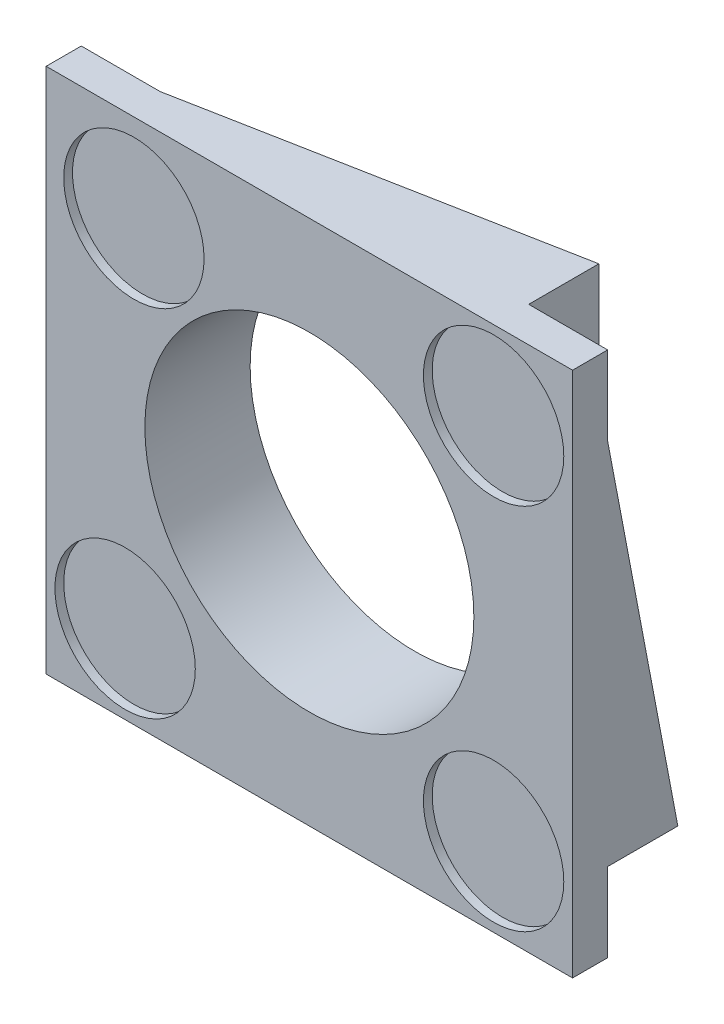
ISO-10303-21;
HEADER;
FILE_DESCRIPTION(('STEP AP214'),'2;1');
FILE_NAME('part.step','',(''),(''),'','','');
FILE_SCHEMA(('AUTOMOTIVE_DESIGN { 1 0 10303 214 1 1 1 1 }'));
ENDSEC;
DATA;
#1=APPLICATION_CONTEXT('core data for automotive mechanical design processes');
#2=APPLICATION_PROTOCOL_DEFINITION('international standard','automotive_design',2000,#1);
#3=PRODUCT_CONTEXT('',#1,'mechanical');
#4=PRODUCT('Part','Part','',(#3));
#5=PRODUCT_RELATED_PRODUCT_CATEGORY('part','',(#4));
#6=PRODUCT_DEFINITION_FORMATION('','',#4);
#7=PRODUCT_DEFINITION_CONTEXT('part definition',#1,'design');
#8=PRODUCT_DEFINITION('design','',#6,#7);
#9=PRODUCT_DEFINITION_SHAPE('','',#8);
#10=(LENGTH_UNIT() NAMED_UNIT(*) SI_UNIT(.MILLI.,.METRE.));
#11=(NAMED_UNIT(*) PLANE_ANGLE_UNIT() SI_UNIT($,.RADIAN.));
#12=(NAMED_UNIT(*) SI_UNIT($,.STERADIAN.) SOLID_ANGLE_UNIT());
#13=UNCERTAINTY_MEASURE_WITH_UNIT(LENGTH_MEASURE(1.E-05),#10,'distance_accuracy_value','');
#14=(GEOMETRIC_REPRESENTATION_CONTEXT(3) GLOBAL_UNCERTAINTY_ASSIGNED_CONTEXT((#13)) GLOBAL_UNIT_ASSIGNED_CONTEXT((#10,
#11,#12)) REPRESENTATION_CONTEXT('',''));
#15=CARTESIAN_POINT('',(0.,0.,0.));
#16=DIRECTION('',(0.,0.,1.));
#17=DIRECTION('',(1.,0.,0.));
#18=AXIS2_PLACEMENT_3D('',#15,#16,#17);
#19=CARTESIAN_POINT('',(-300.,-300.,120.));
#20=DIRECTION('',(0.,1.,0.));
#21=DIRECTION('',(0.,0.,1.));
#22=AXIS2_PLACEMENT_3D('',#19,#20,#21);
#23=PLANE('',#22);
#24=DIRECTION('',(0.982338566422475,0.,0.187112107889995));
#25=VECTOR('',#24,1.);
#26=CARTESIAN_POINT('',(-7.35229759299782,-300.,38.5995623632385));
#27=LINE('',#26,#25);
#28=CARTESIAN_POINT('',(-210.,-300.,0.));
#29=VERTEX_POINT('',#28);
#30=CARTESIAN_POINT('',(210.,-300.,80.));
#31=VERTEX_POINT('',#30);
#32=EDGE_CURVE('E188',#29,#31,#27,.T.);
#33=ORIENTED_EDGE('',*,*,#32,.T.);
#34=DIRECTION('',(1.,0.,0.));
#35=VECTOR('',#34,1.);
#36=CARTESIAN_POINT('',(210.,-300.,80.));
#37=LINE('',#36,#35);
#38=CARTESIAN_POINT('',(300.,-300.,80.));
#39=VERTEX_POINT('',#38);
#40=EDGE_CURVE('E177',#31,#39,#37,.T.);
#41=ORIENTED_EDGE('',*,*,#40,.T.);
#42=DIRECTION('',(0.,0.,-1.));
#43=VECTOR('',#42,1.);
#44=CARTESIAN_POINT('',(300.,-300.,120.));
#45=LINE('',#44,#43);
#46=CARTESIAN_POINT('',(300.,-300.,120.));
#47=VERTEX_POINT('',#46);
#48=EDGE_CURVE('E332',#47,#39,#45,.T.);
#49=ORIENTED_EDGE('',*,*,#48,.F.);
#50=DIRECTION('',(1.,0.,0.));
#51=VECTOR('',#50,1.);
#52=CARTESIAN_POINT('',(-300.,-300.,120.));
#53=LINE('',#52,#51);
#54=CARTESIAN_POINT('',(-300.,-300.,120.));
#55=VERTEX_POINT('',#54);
#56=EDGE_CURVE('E55',#55,#47,#53,.T.);
#57=ORIENTED_EDGE('',*,*,#56,.F.);
#58=DIRECTION('',(0.,0.,-1.));
#59=VECTOR('',#58,1.);
#60=CARTESIAN_POINT('',(-300.,-300.,120.));
#61=LINE('',#60,#59);
#62=CARTESIAN_POINT('',(-300.,-300.,80.));
#63=VERTEX_POINT('',#62);
#64=EDGE_CURVE('E334',#55,#63,#61,.T.);
#65=ORIENTED_EDGE('',*,*,#64,.T.);
#66=DIRECTION('',(-1.,0.,0.));
#67=VECTOR('',#66,1.);
#68=CARTESIAN_POINT('',(-210.,-300.,80.));
#69=LINE('',#68,#67);
#70=CARTESIAN_POINT('',(-210.,-300.,80.));
#71=VERTEX_POINT('',#70);
#72=EDGE_CURVE('E287',#71,#63,#69,.T.);
#73=ORIENTED_EDGE('',*,*,#72,.F.);
#74=DIRECTION('',(0.,0.,1.));
#75=VECTOR('',#74,1.);
#76=CARTESIAN_POINT('',(-210.,-300.,80.));
#77=LINE('',#76,#75);
#78=EDGE_CURVE('E203',#29,#71,#77,.T.);
#79=ORIENTED_EDGE('',*,*,#78,.F.);
#80=EDGE_LOOP('',(#33,#41,#49,#57,#65,#73,#79));
#81=FACE_BOUND('',#80,.T.);
#82=ADVANCED_FACE('F40',(#81),#23,.F.);
#83=CARTESIAN_POINT('',(0.,0.,0.));
#84=DIRECTION('',(0.,0.,1.));
#85=DIRECTION('',(1.,0.,0.));
#86=AXIS2_PLACEMENT_3D('',#83,#84,#85);
#87=PLANE('',#86);
#88=CARTESIAN_POINT('',(0.,0.,0.));
#89=DIRECTION('',(0.,0.,1.));
#90=DIRECTION('',(1.,0.,0.));
#91=AXIS2_PLACEMENT_3D('',#88,#89,#90);
#92=CIRCLE('',#91,187.5);
#93=CARTESIAN_POINT('',(187.5,0.,0.));
#94=VERTEX_POINT('',#93);
#95=EDGE_CURVE('E319',#94,#94,#92,.T.);
#96=ORIENTED_EDGE('',*,*,#95,.T.);
#97=EDGE_LOOP('',(#96));
#98=FACE_BOUND('',#97,.T.);
#99=DIRECTION('',(0.,1.,0.));
#100=VECTOR('',#99,1.);
#101=CARTESIAN_POINT('',(220.,0.,0.));
#102=LINE('',#101,#100);
#103=CARTESIAN_POINT('',(220.,-210.,0.));
#104=VERTEX_POINT('',#103);
#105=CARTESIAN_POINT('',(220.,210.,0.));
#106=VERTEX_POINT('',#105);
#107=EDGE_CURVE('E234',#104,#106,#102,.T.);
#108=ORIENTED_EDGE('',*,*,#107,.F.);
#109=DIRECTION('',(1.,0.,0.));
#110=VECTOR('',#109,1.);
#111=CARTESIAN_POINT('',(210.,-210.,0.));
#112=LINE('',#111,#110);
#113=CARTESIAN_POINT('',(210.,-210.,0.));
#114=VERTEX_POINT('',#113);
#115=EDGE_CURVE('E388',#114,#104,#112,.T.);
#116=ORIENTED_EDGE('',*,*,#115,.F.);
#117=DIRECTION('',(0.,-1.,0.));
#118=VECTOR('',#117,1.);
#119=CARTESIAN_POINT('',(210.,-210.,0.));
#120=LINE('',#119,#118);
#121=CARTESIAN_POINT('',(210.,-220.,0.));
#122=VERTEX_POINT('',#121);
#123=EDGE_CURVE('E413',#114,#122,#120,.T.);
#124=ORIENTED_EDGE('',*,*,#123,.T.);
#125=DIRECTION('',(1.,0.,0.));
#126=VECTOR('',#125,1.);
#127=CARTESIAN_POINT('',(0.,-220.,0.));
#128=LINE('',#127,#126);
#129=CARTESIAN_POINT('',(-210.,-220.,0.));
#130=VERTEX_POINT('',#129);
#131=EDGE_CURVE('E205',#130,#122,#128,.T.);
#132=ORIENTED_EDGE('',*,*,#131,.F.);
#133=DIRECTION('',(0.,-1.,0.));
#134=VECTOR('',#133,1.);
#135=CARTESIAN_POINT('',(-210.,-210.,0.));
#136=LINE('',#135,#134);
#137=CARTESIAN_POINT('',(-210.,-210.,0.));
#138=VERTEX_POINT('',#137);
#139=EDGE_CURVE('E281',#138,#130,#136,.T.);
#140=ORIENTED_EDGE('',*,*,#139,.F.);
#141=DIRECTION('',(-1.,0.,0.));
#142=VECTOR('',#141,1.);
#143=CARTESIAN_POINT('',(-210.,-210.,0.));
#144=LINE('',#143,#142);
#145=CARTESIAN_POINT('',(-220.,-210.,0.));
#146=VERTEX_POINT('',#145);
#147=EDGE_CURVE('E290',#138,#146,#144,.T.);
#148=ORIENTED_EDGE('',*,*,#147,.T.);
#149=DIRECTION('',(0.,-1.,0.));
#150=VECTOR('',#149,1.);
#151=CARTESIAN_POINT('',(-220.,0.,0.));
#152=LINE('',#151,#150);
#153=CARTESIAN_POINT('',(-220.,210.,0.));
#154=VERTEX_POINT('',#153);
#155=EDGE_CURVE('E307',#154,#146,#152,.T.);
#156=ORIENTED_EDGE('',*,*,#155,.F.);
#157=DIRECTION('',(-1.,0.,0.));
#158=VECTOR('',#157,1.);
#159=CARTESIAN_POINT('',(-210.,210.,0.));
#160=LINE('',#159,#158);
#161=CARTESIAN_POINT('',(-210.,210.,0.));
#162=VERTEX_POINT('',#161);
#163=EDGE_CURVE('E250',#162,#154,#160,.T.);
#164=ORIENTED_EDGE('',*,*,#163,.F.);
#165=DIRECTION('',(0.,1.,0.));
#166=VECTOR('',#165,1.);
#167=CARTESIAN_POINT('',(-210.,210.,0.));
#168=LINE('',#167,#166);
#169=CARTESIAN_POINT('',(-210.,220.,0.));
#170=VERTEX_POINT('',#169);
#171=EDGE_CURVE('E252',#162,#170,#168,.T.);
#172=ORIENTED_EDGE('',*,*,#171,.T.);
#173=DIRECTION('',(-1.,0.,0.));
#174=VECTOR('',#173,1.);
#175=CARTESIAN_POINT('',(0.,220.,0.));
#176=LINE('',#175,#174);
#177=CARTESIAN_POINT('',(210.,220.,0.));
#178=VERTEX_POINT('',#177);
#179=EDGE_CURVE('E264',#178,#170,#176,.T.);
#180=ORIENTED_EDGE('',*,*,#179,.F.);
#181=DIRECTION('',(0.,1.,0.));
#182=VECTOR('',#181,1.);
#183=CARTESIAN_POINT('',(210.,210.,0.));
#184=LINE('',#183,#182);
#185=CARTESIAN_POINT('',(210.,210.,0.));
#186=VERTEX_POINT('',#185);
#187=EDGE_CURVE('E224',#186,#178,#184,.T.);
#188=ORIENTED_EDGE('',*,*,#187,.F.);
#189=DIRECTION('',(-1.,0.,0.));
#190=VECTOR('',#189,1.);
#191=CARTESIAN_POINT('',(210.,210.,0.));
#192=LINE('',#191,#190);
#193=EDGE_CURVE('E218',#106,#186,#192,.T.);
#194=ORIENTED_EDGE('',*,*,#193,.F.);
#195=EDGE_LOOP('',(#108,#116,#124,#132,#140,#148,#156,#164,#172,#180,#188,#194));
#196=FACE_BOUND('',#195,.T.);
#197=ADVANCED_FACE('F380',(#98,#196),#87,.F.);
#198=CARTESIAN_POINT('',(300.,300.,120.));
#199=DIRECTION('',(-1.,0.,0.));
#200=DIRECTION('',(0.,-1.,0.));
#201=AXIS2_PLACEMENT_3D('',#198,#199,#200);
#202=PLANE('',#201);
#203=ORIENTED_EDGE('',*,*,#48,.T.);
#204=DIRECTION('',(0.,-1.,0.));
#205=VECTOR('',#204,1.);
#206=CARTESIAN_POINT('',(300.,-210.,80.));
#207=LINE('',#206,#205);
#208=CARTESIAN_POINT('',(300.,-210.,80.));
#209=VERTEX_POINT('',#208);
#210=EDGE_CURVE('E184',#209,#39,#207,.T.);
#211=ORIENTED_EDGE('',*,*,#210,.F.);
#212=DIRECTION('',(0.,0.,1.));
#213=VECTOR('',#212,1.);
#214=CARTESIAN_POINT('',(300.,-210.,0.));
#215=LINE('',#214,#213);
#216=CARTESIAN_POINT('',(300.,-210.,0.));
#217=VERTEX_POINT('',#216);
#218=EDGE_CURVE('E402',#217,#209,#215,.T.);
#219=ORIENTED_EDGE('',*,*,#218,.F.);
#220=DIRECTION('',(0.,0.982338566422475,0.187112107889995));
#221=VECTOR('',#220,1.);
#222=CARTESIAN_POINT('',(300.,-7.35229759299774,38.5995623632385));
#223=LINE('',#222,#221);
#224=CARTESIAN_POINT('',(300.,210.,80.));
#225=VERTEX_POINT('',#224);
#226=EDGE_CURVE('E226',#217,#225,#223,.T.);
#227=ORIENTED_EDGE('',*,*,#226,.T.);
#228=DIRECTION('',(0.,1.,0.));
#229=VECTOR('',#228,1.);
#230=CARTESIAN_POINT('',(300.,210.,80.));
#231=LINE('',#230,#229);
#232=CARTESIAN_POINT('',(300.,300.,80.));
#233=VERTEX_POINT('',#232);
#234=EDGE_CURVE('E227',#225,#233,#231,.T.);
#235=ORIENTED_EDGE('',*,*,#234,.T.);
#236=DIRECTION('',(0.,0.,-1.));
#237=VECTOR('',#236,1.);
#238=CARTESIAN_POINT('',(300.,300.,120.));
#239=LINE('',#238,#237);
#240=CARTESIAN_POINT('',(300.,300.,120.));
#241=VERTEX_POINT('',#240);
#242=EDGE_CURVE('E11',#241,#233,#239,.T.);
#243=ORIENTED_EDGE('',*,*,#242,.F.);
#244=DIRECTION('',(0.,1.,0.));
#245=VECTOR('',#244,1.);
#246=CARTESIAN_POINT('',(300.,300.,120.));
#247=LINE('',#246,#245);
#248=EDGE_CURVE('E324',#47,#241,#247,.T.);
#249=ORIENTED_EDGE('',*,*,#248,.F.);
#250=EDGE_LOOP('',(#203,#211,#219,#227,#235,#243,#249));
#251=FACE_BOUND('',#250,.T.);
#252=ADVANCED_FACE('F42',(#251),#202,.F.);
#253=CARTESIAN_POINT('',(-300.,300.,120.));
#254=DIRECTION('',(1.,0.,0.));
#255=DIRECTION('',(0.,1.,0.));
#256=AXIS2_PLACEMENT_3D('',#253,#254,#255);
#257=PLANE('',#256);
#258=DIRECTION('',(0.,-0.982338566422475,0.187112107889995));
#259=VECTOR('',#258,1.);
#260=CARTESIAN_POINT('',(-300.,7.35229759299778,38.5995623632385));
#261=LINE('',#260,#259);
#262=CARTESIAN_POINT('',(-300.,210.,0.));
#263=VERTEX_POINT('',#262);
#264=CARTESIAN_POINT('',(-300.,-210.,80.));
#265=VERTEX_POINT('',#264);
#266=EDGE_CURVE('E302',#263,#265,#261,.T.);
#267=ORIENTED_EDGE('',*,*,#266,.T.);
#268=DIRECTION('',(0.,1.,0.));
#269=VECTOR('',#268,1.);
#270=CARTESIAN_POINT('',(-300.,-210.,80.));
#271=LINE('',#270,#269);
#272=EDGE_CURVE('E272',#63,#265,#271,.T.);
#273=ORIENTED_EDGE('',*,*,#272,.F.);
#274=ORIENTED_EDGE('',*,*,#64,.F.);
#275=DIRECTION('',(0.,-1.,0.));
#276=VECTOR('',#275,1.);
#277=CARTESIAN_POINT('',(-300.,300.,120.));
#278=LINE('',#277,#276);
#279=CARTESIAN_POINT('',(-300.,300.,120.));
#280=VERTEX_POINT('',#279);
#281=EDGE_CURVE('E60',#280,#55,#278,.T.);
#282=ORIENTED_EDGE('',*,*,#281,.F.);
#283=DIRECTION('',(0.,0.,-1.));
#284=VECTOR('',#283,1.);
#285=CARTESIAN_POINT('',(-300.,300.,120.));
#286=LINE('',#285,#284);
#287=CARTESIAN_POINT('',(-300.,300.,80.));
#288=VERTEX_POINT('',#287);
#289=EDGE_CURVE('E48',#280,#288,#286,.T.);
#290=ORIENTED_EDGE('',*,*,#289,.T.);
#291=DIRECTION('',(0.,1.,0.));
#292=VECTOR('',#291,1.);
#293=CARTESIAN_POINT('',(-300.,0.,80.));
#294=LINE('',#293,#292);
#295=CARTESIAN_POINT('',(-300.,210.,80.));
#296=VERTEX_POINT('',#295);
#297=EDGE_CURVE('E296',#296,#288,#294,.T.);
#298=ORIENTED_EDGE('',*,*,#297,.F.);
#299=DIRECTION('',(0.,0.,1.));
#300=VECTOR('',#299,1.);
#301=CARTESIAN_POINT('',(-300.,210.,0.));
#302=LINE('',#301,#300);
#303=EDGE_CURVE('E289',#263,#296,#302,.T.);
#304=ORIENTED_EDGE('',*,*,#303,.F.);
#305=EDGE_LOOP('',(#267,#273,#274,#282,#290,#298,#304));
#306=FACE_BOUND('',#305,.T.);
#307=ADVANCED_FACE('F340',(#306),#257,.F.);
#308=CARTESIAN_POINT('',(0.,0.,120.));
#309=DIRECTION('',(0.,0.,1.));
#310=DIRECTION('',(1.,0.,0.));
#311=AXIS2_PLACEMENT_3D('',#308,#309,#310);
#312=PLANE('',#311);
#313=CARTESIAN_POINT('',(-210.,-210.,120.));
#314=DIRECTION('',(0.,0.,1.));
#315=DIRECTION('',(1.,0.,0.));
#316=AXIS2_PLACEMENT_3D('',#313,#314,#315);
#317=CIRCLE('',#316,80.);
#318=CARTESIAN_POINT('',(-130.,-210.,120.));
#319=VERTEX_POINT('',#318);
#320=EDGE_CURVE('E442',#319,#319,#317,.T.);
#321=ORIENTED_EDGE('',*,*,#320,.F.);
#322=EDGE_LOOP('',(#321));
#323=FACE_BOUND('',#322,.T.);
#324=CARTESIAN_POINT('',(210.,-210.,120.));
#325=DIRECTION('',(0.,0.,1.));
#326=DIRECTION('',(1.,0.,0.));
#327=AXIS2_PLACEMENT_3D('',#324,#325,#326);
#328=CIRCLE('',#327,80.);
#329=CARTESIAN_POINT('',(290.,-210.,120.));
#330=VERTEX_POINT('',#329);
#331=EDGE_CURVE('E439',#330,#330,#328,.T.);
#332=ORIENTED_EDGE('',*,*,#331,.F.);
#333=EDGE_LOOP('',(#332));
#334=FACE_BOUND('',#333,.T.);
#335=CARTESIAN_POINT('',(210.,210.,120.));
#336=DIRECTION('',(0.,0.,1.));
#337=DIRECTION('',(1.,0.,0.));
#338=AXIS2_PLACEMENT_3D('',#335,#336,#337);
#339=CIRCLE('',#338,80.);
#340=CARTESIAN_POINT('',(290.,210.,120.));
#341=VERTEX_POINT('',#340);
#342=EDGE_CURVE('E433',#341,#341,#339,.T.);
#343=ORIENTED_EDGE('',*,*,#342,.F.);
#344=EDGE_LOOP('',(#343));
#345=FACE_BOUND('',#344,.T.);
#346=CARTESIAN_POINT('',(-200.,200.,120.));
#347=DIRECTION('',(0.,0.,1.));
#348=DIRECTION('',(1.,0.,0.));
#349=AXIS2_PLACEMENT_3D('',#346,#347,#348);
#350=CIRCLE('',#349,80.);
#351=CARTESIAN_POINT('',(-120.,200.,120.));
#352=VERTEX_POINT('',#351);
#353=EDGE_CURVE('E424',#352,#352,#350,.T.);
#354=ORIENTED_EDGE('',*,*,#353,.F.);
#355=EDGE_LOOP('',(#354));
#356=FACE_BOUND('',#355,.T.);
#357=ORIENTED_EDGE('',*,*,#248,.T.);
#358=DIRECTION('',(-1.,0.,0.));
#359=VECTOR('',#358,1.);
#360=CARTESIAN_POINT('',(-300.,300.,120.));
#361=LINE('',#360,#359);
#362=EDGE_CURVE('E328',#241,#280,#361,.T.);
#363=ORIENTED_EDGE('',*,*,#362,.T.);
#364=ORIENTED_EDGE('',*,*,#281,.T.);
#365=ORIENTED_EDGE('',*,*,#56,.T.);
#366=EDGE_LOOP('',(#357,#363,#364,#365));
#367=FACE_BOUND('',#366,.T.);
#368=CARTESIAN_POINT('',(0.,0.,120.));
#369=DIRECTION('',(0.,0.,1.));
#370=DIRECTION('',(1.,0.,0.));
#371=AXIS2_PLACEMENT_3D('',#368,#369,#370);
#372=CIRCLE('',#371,187.5);
#373=CARTESIAN_POINT('',(187.5,0.,120.));
#374=VERTEX_POINT('',#373);
#375=EDGE_CURVE('E321',#374,#374,#372,.T.);
#376=ORIENTED_EDGE('',*,*,#375,.F.);
#377=EDGE_LOOP('',(#376));
#378=FACE_BOUND('',#377,.T.);
#379=ADVANCED_FACE('F367',(#323,#334,#345,#356,#367,#378),#312,.T.);
#380=CARTESIAN_POINT('',(-300.,300.,120.));
#381=DIRECTION('',(0.,-1.,0.));
#382=DIRECTION('',(0.,0.,-1.));
#383=AXIS2_PLACEMENT_3D('',#380,#381,#382);
#384=PLANE('',#383);
#385=DIRECTION('',(1.,0.,0.));
#386=VECTOR('',#385,1.);
#387=CARTESIAN_POINT('',(210.,300.,80.));
#388=LINE('',#387,#386);
#389=CARTESIAN_POINT('',(210.,300.,80.));
#390=VERTEX_POINT('',#389);
#391=EDGE_CURVE('E216',#390,#233,#388,.T.);
#392=ORIENTED_EDGE('',*,*,#391,.F.);
#393=DIRECTION('',(0.,0.,1.));
#394=VECTOR('',#393,1.);
#395=CARTESIAN_POINT('',(210.,300.,0.));
#396=LINE('',#395,#394);
#397=CARTESIAN_POINT('',(210.,300.,0.));
#398=VERTEX_POINT('',#397);
#399=EDGE_CURVE('E197',#398,#390,#396,.T.);
#400=ORIENTED_EDGE('',*,*,#399,.F.);
#401=DIRECTION('',(0.982338566422475,0.,-0.187112107889995));
#402=VECTOR('',#401,1.);
#403=CARTESIAN_POINT('',(7.35229759299782,300.,38.5995623632385));
#404=LINE('',#403,#402);
#405=CARTESIAN_POINT('',(-210.,300.,80.0000000000001));
#406=VERTEX_POINT('',#405);
#407=EDGE_CURVE('E255',#406,#398,#404,.T.);
#408=ORIENTED_EDGE('',*,*,#407,.F.);
#409=DIRECTION('',(-1.,0.,0.));
#410=VECTOR('',#409,1.);
#411=CARTESIAN_POINT('',(-220.,300.,80.));
#412=LINE('',#411,#410);
#413=EDGE_CURVE('E300',#406,#288,#412,.T.);
#414=ORIENTED_EDGE('',*,*,#413,.T.);
#415=ORIENTED_EDGE('',*,*,#289,.F.);
#416=ORIENTED_EDGE('',*,*,#362,.F.);
#417=ORIENTED_EDGE('',*,*,#242,.T.);
#418=EDGE_LOOP('',(#392,#400,#408,#414,#415,#416,#417));
#419=FACE_BOUND('',#418,.T.);
#420=ADVANCED_FACE('F344',(#419),#384,.F.);
#421=CARTESIAN_POINT('',(0.,0.,120.));
#422=DIRECTION('',(0.,0.,-1.));
#423=DIRECTION('',(-1.,0.,0.));
#424=AXIS2_PLACEMENT_3D('',#421,#422,#423);
#425=CYLINDRICAL_SURFACE('',#424,187.5);
#426=ORIENTED_EDGE('',*,*,#375,.T.);
#427=EDGE_LOOP('',(#426));
#428=FACE_BOUND('',#427,.T.);
#429=ORIENTED_EDGE('',*,*,#95,.F.);
#430=EDGE_LOOP('',(#429));
#431=FACE_BOUND('',#430,.T.);
#432=ADVANCED_FACE('F374',(#428,#431),#425,.F.);
#433=CARTESIAN_POINT('',(-220.,7.35229759299779,38.5995623632385));
#434=DIRECTION('',(0.,-0.187112107889995,-0.982338566422475));
#435=DIRECTION('',(0.,0.982338566422475,-0.187112107889995));
#436=AXIS2_PLACEMENT_3D('',#433,#434,#435);
#437=PLANE('',#436);
#438=ORIENTED_EDGE('',*,*,#266,.F.);
#439=DIRECTION('',(-1.,0.,0.));
#440=VECTOR('',#439,1.);
#441=CARTESIAN_POINT('',(-220.,210.,0.));
#442=LINE('',#441,#440);
#443=EDGE_CURVE('E313',#154,#263,#442,.T.);
#444=ORIENTED_EDGE('',*,*,#443,.F.);
#445=DIRECTION('',(0.,-0.982338566422475,0.187112107889995));
#446=VECTOR('',#445,1.);
#447=CARTESIAN_POINT('',(-220.,7.35229759299779,38.5995623632385));
#448=LINE('',#447,#446);
#449=CARTESIAN_POINT('',(-220.,-210.,80.));
#450=VERTEX_POINT('',#449);
#451=EDGE_CURVE('E304',#154,#450,#448,.T.);
#452=ORIENTED_EDGE('',*,*,#451,.T.);
#453=DIRECTION('',(-1.,0.,0.));
#454=VECTOR('',#453,1.);
#455=CARTESIAN_POINT('',(-220.,-210.,80.));
#456=LINE('',#455,#454);
#457=EDGE_CURVE('E316',#450,#265,#456,.T.);
#458=ORIENTED_EDGE('',*,*,#457,.T.);
#459=EDGE_LOOP('',(#438,#444,#452,#458));
#460=FACE_BOUND('',#459,.T.);
#461=ADVANCED_FACE('F358',(#460),#437,.T.);
#462=CARTESIAN_POINT('',(-220.,0.,0.));
#463=DIRECTION('',(-1.,0.,0.));
#464=DIRECTION('',(0.,-1.,0.));
#465=AXIS2_PLACEMENT_3D('',#462,#463,#464);
#466=PLANE('',#465);
#467=ORIENTED_EDGE('',*,*,#451,.F.);
#468=ORIENTED_EDGE('',*,*,#155,.T.);
#469=DIRECTION('',(0.,0.,1.));
#470=VECTOR('',#469,1.);
#471=CARTESIAN_POINT('',(-220.,-210.,0.));
#472=LINE('',#471,#470);
#473=EDGE_CURVE('E310',#146,#450,#472,.T.);
#474=ORIENTED_EDGE('',*,*,#473,.T.);
#475=EDGE_LOOP('',(#467,#468,#474));
#476=FACE_BOUND('',#475,.T.);
#477=ADVANCED_FACE('F588',(#476),#466,.T.);
#478=CARTESIAN_POINT('',(-220.,210.,0.));
#479=DIRECTION('',(0.,-1.,0.));
#480=DIRECTION('',(1.,0.,0.));
#481=AXIS2_PLACEMENT_3D('',#478,#479,#480);
#482=PLANE('',#481);
#483=ORIENTED_EDGE('',*,*,#303,.T.);
#484=DIRECTION('',(-1.,0.,0.));
#485=VECTOR('',#484,1.);
#486=CARTESIAN_POINT('',(-220.,210.,80.));
#487=LINE('',#486,#485);
#488=CARTESIAN_POINT('',(-210.,210.,80.0000000000001));
#489=VERTEX_POINT('',#488);
#490=EDGE_CURVE('E299',#489,#296,#487,.T.);
#491=ORIENTED_EDGE('',*,*,#490,.F.);
#492=DIRECTION('',(0.,0.,-1.));
#493=VECTOR('',#492,1.);
#494=CARTESIAN_POINT('',(-210.,210.,80.0000000000001));
#495=LINE('',#494,#493);
#496=EDGE_CURVE('E246',#489,#162,#495,.T.);
#497=ORIENTED_EDGE('',*,*,#496,.T.);
#498=ORIENTED_EDGE('',*,*,#163,.T.);
#499=ORIENTED_EDGE('',*,*,#443,.T.);
#500=EDGE_LOOP('',(#483,#491,#497,#498,#499));
#501=FACE_BOUND('',#500,.T.);
#502=ADVANCED_FACE('F353',(#501),#482,.F.);
#503=CARTESIAN_POINT('',(-220.,0.,80.));
#504=DIRECTION('',(0.,0.,1.));
#505=DIRECTION('',(1.,0.,0.));
#506=AXIS2_PLACEMENT_3D('',#503,#504,#505);
#507=PLANE('',#506);
#508=ORIENTED_EDGE('',*,*,#297,.T.);
#509=ORIENTED_EDGE('',*,*,#413,.F.);
#510=DIRECTION('',(0.,1.,0.));
#511=VECTOR('',#510,1.);
#512=CARTESIAN_POINT('',(-210.,220.,80.0000000000001));
#513=LINE('',#512,#511);
#514=CARTESIAN_POINT('',(-210.,220.,80.0000000000001));
#515=VERTEX_POINT('',#514);
#516=EDGE_CURVE('E267',#515,#406,#513,.T.);
#517=ORIENTED_EDGE('',*,*,#516,.F.);
#518=DIRECTION('',(0.,1.,0.));
#519=VECTOR('',#518,1.);
#520=CARTESIAN_POINT('',(-210.,210.,80.0000000000001));
#521=LINE('',#520,#519);
#522=EDGE_CURVE('E253',#489,#515,#521,.T.);
#523=ORIENTED_EDGE('',*,*,#522,.F.);
#524=ORIENTED_EDGE('',*,*,#490,.T.);
#525=EDGE_LOOP('',(#508,#509,#517,#523,#524));
#526=FACE_BOUND('',#525,.T.);
#527=ADVANCED_FACE('F349',(#526),#507,.F.);
#528=CARTESIAN_POINT('',(-210.,-210.,80.));
#529=DIRECTION('',(0.,0.,1.));
#530=DIRECTION('',(0.,-1.,0.));
#531=AXIS2_PLACEMENT_3D('',#528,#529,#530);
#532=PLANE('',#531);
#533=ORIENTED_EDGE('',*,*,#272,.T.);
#534=ORIENTED_EDGE('',*,*,#457,.F.);
#535=DIRECTION('',(-1.,0.,0.));
#536=VECTOR('',#535,1.);
#537=CARTESIAN_POINT('',(-210.,-210.,80.));
#538=LINE('',#537,#536);
#539=CARTESIAN_POINT('',(-210.,-210.,80.));
#540=VERTEX_POINT('',#539);
#541=EDGE_CURVE('E285',#540,#450,#538,.T.);
#542=ORIENTED_EDGE('',*,*,#541,.F.);
#543=DIRECTION('',(0.,1.,0.));
#544=VECTOR('',#543,1.);
#545=CARTESIAN_POINT('',(-210.,-210.,80.));
#546=LINE('',#545,#544);
#547=EDGE_CURVE('E275',#71,#540,#546,.T.);
#548=ORIENTED_EDGE('',*,*,#547,.F.);
#549=ORIENTED_EDGE('',*,*,#72,.T.);
#550=EDGE_LOOP('',(#533,#534,#542,#548,#549));
#551=FACE_BOUND('',#550,.T.);
#552=ADVANCED_FACE('F362',(#551),#532,.F.);
#553=CARTESIAN_POINT('',(-210.,-210.,80.));
#554=DIRECTION('',(0.,1.,0.));
#555=DIRECTION('',(-1.,0.,0.));
#556=AXIS2_PLACEMENT_3D('',#553,#554,#555);
#557=PLANE('',#556);
#558=ORIENTED_EDGE('',*,*,#473,.F.);
#559=ORIENTED_EDGE('',*,*,#147,.F.);
#560=DIRECTION('',(0.,0.,-1.));
#561=VECTOR('',#560,1.);
#562=CARTESIAN_POINT('',(-210.,-210.,80.));
#563=LINE('',#562,#561);
#564=EDGE_CURVE('E278',#540,#138,#563,.T.);
#565=ORIENTED_EDGE('',*,*,#564,.F.);
#566=ORIENTED_EDGE('',*,*,#541,.T.);
#567=EDGE_LOOP('',(#558,#559,#565,#566));
#568=FACE_BOUND('',#567,.T.);
#569=ADVANCED_FACE('F548',(#568),#557,.F.);
#570=CARTESIAN_POINT('',(-210.,-1.76710498086171E-13,0.));
#571=DIRECTION('',(1.,0.,0.));
#572=DIRECTION('',(0.,1.,0.));
#573=AXIS2_PLACEMENT_3D('',#570,#571,#572);
#574=PLANE('',#573);
#575=ORIENTED_EDGE('',*,*,#547,.T.);
#576=ORIENTED_EDGE('',*,*,#564,.T.);
#577=ORIENTED_EDGE('',*,*,#139,.T.);
#578=DIRECTION('',(0.,-1.,0.));
#579=VECTOR('',#578,1.);
#580=CARTESIAN_POINT('',(-210.,-220.,0.));
#581=LINE('',#580,#579);
#582=EDGE_CURVE('E198',#130,#29,#581,.T.);
#583=ORIENTED_EDGE('',*,*,#582,.T.);
#584=ORIENTED_EDGE('',*,*,#78,.T.);
#585=EDGE_LOOP('',(#575,#576,#577,#583,#584));
#586=FACE_BOUND('',#585,.T.);
#587=ADVANCED_FACE('F503',(#586),#574,.F.);
#588=CARTESIAN_POINT('',(7.35229759299782,220.,38.5995623632385));
#589=DIRECTION('',(0.187112107889995,0.,0.982338566422475));
#590=DIRECTION('',(0.982338566422475,0.,-0.187112107889995));
#591=AXIS2_PLACEMENT_3D('',#588,#589,#590);
#592=PLANE('',#591);
#593=ORIENTED_EDGE('',*,*,#407,.T.);
#594=DIRECTION('',(0.,1.,0.));
#595=VECTOR('',#594,1.);
#596=CARTESIAN_POINT('',(210.,220.,0.));
#597=LINE('',#596,#595);
#598=EDGE_CURVE('E270',#178,#398,#597,.T.);
#599=ORIENTED_EDGE('',*,*,#598,.F.);
#600=DIRECTION('',(0.982338566422475,0.,-0.187112107889995));
#601=VECTOR('',#600,1.);
#602=CARTESIAN_POINT('',(7.35229759299782,220.,38.5995623632385));
#603=LINE('',#602,#601);
#604=EDGE_CURVE('E261',#515,#178,#603,.T.);
#605=ORIENTED_EDGE('',*,*,#604,.F.);
#606=ORIENTED_EDGE('',*,*,#516,.T.);
#607=EDGE_LOOP('',(#593,#599,#605,#606));
#608=FACE_BOUND('',#607,.T.);
#609=ADVANCED_FACE('F498',(#608),#592,.F.);
#610=CARTESIAN_POINT('',(0.,220.,0.));
#611=DIRECTION('',(0.,1.,0.));
#612=DIRECTION('',(0.,0.,1.));
#613=AXIS2_PLACEMENT_3D('',#610,#611,#612);
#614=PLANE('',#613);
#615=DIRECTION('',(0.,0.,1.));
#616=VECTOR('',#615,1.);
#617=CARTESIAN_POINT('',(-210.,220.,0.));
#618=LINE('',#617,#616);
#619=EDGE_CURVE('E258',#170,#515,#618,.T.);
#620=ORIENTED_EDGE('',*,*,#619,.T.);
#621=ORIENTED_EDGE('',*,*,#604,.T.);
#622=ORIENTED_EDGE('',*,*,#179,.T.);
#623=EDGE_LOOP('',(#620,#621,#622));
#624=FACE_BOUND('',#623,.T.);
#625=ADVANCED_FACE('F502',(#624),#614,.T.);
#626=CARTESIAN_POINT('',(-210.,210.,80.0000000000001));
#627=DIRECTION('',(1.,0.,0.));
#628=DIRECTION('',(0.,0.,-1.));
#629=AXIS2_PLACEMENT_3D('',#626,#627,#628);
#630=PLANE('',#629);
#631=ORIENTED_EDGE('',*,*,#619,.F.);
#632=ORIENTED_EDGE('',*,*,#171,.F.);
#633=ORIENTED_EDGE('',*,*,#496,.F.);
#634=ORIENTED_EDGE('',*,*,#522,.T.);
#635=EDGE_LOOP('',(#631,#632,#633,#634));
#636=FACE_BOUND('',#635,.T.);
#637=ADVANCED_FACE('F494',(#636),#630,.F.);
#638=CARTESIAN_POINT('',(220.,-7.35229759299775,38.5995623632385));
#639=DIRECTION('',(0.,0.187112107889995,-0.982338566422475));
#640=DIRECTION('',(0.,0.982338566422475,0.187112107889995));
#641=AXIS2_PLACEMENT_3D('',#638,#639,#640);
#642=PLANE('',#641);
#643=ORIENTED_EDGE('',*,*,#226,.F.);
#644=DIRECTION('',(1.,0.,0.));
#645=VECTOR('',#644,1.);
#646=CARTESIAN_POINT('',(220.,-210.,0.));
#647=LINE('',#646,#645);
#648=EDGE_CURVE('E240',#104,#217,#647,.T.);
#649=ORIENTED_EDGE('',*,*,#648,.F.);
#650=DIRECTION('',(0.,0.982338566422475,0.187112107889995));
#651=VECTOR('',#650,1.);
#652=CARTESIAN_POINT('',(220.,-7.35229759299775,38.5995623632385));
#653=LINE('',#652,#651);
#654=CARTESIAN_POINT('',(220.,210.,80.));
#655=VERTEX_POINT('',#654);
#656=EDGE_CURVE('E231',#104,#655,#653,.T.);
#657=ORIENTED_EDGE('',*,*,#656,.T.);
#658=DIRECTION('',(1.,0.,0.));
#659=VECTOR('',#658,1.);
#660=CARTESIAN_POINT('',(220.,210.,80.));
#661=LINE('',#660,#659);
#662=EDGE_CURVE('E243',#655,#225,#661,.T.);
#663=ORIENTED_EDGE('',*,*,#662,.T.);
#664=EDGE_LOOP('',(#643,#649,#657,#663));
#665=FACE_BOUND('',#664,.T.);
#666=ADVANCED_FACE('F396',(#665),#642,.T.);
#667=CARTESIAN_POINT('',(220.,0.,0.));
#668=DIRECTION('',(1.,0.,0.));
#669=DIRECTION('',(0.,1.,0.));
#670=AXIS2_PLACEMENT_3D('',#667,#668,#669);
#671=PLANE('',#670);
#672=ORIENTED_EDGE('',*,*,#656,.F.);
#673=ORIENTED_EDGE('',*,*,#107,.T.);
#674=DIRECTION('',(0.,0.,1.));
#675=VECTOR('',#674,1.);
#676=CARTESIAN_POINT('',(220.,210.,0.));
#677=LINE('',#676,#675);
#678=EDGE_CURVE('E237',#106,#655,#677,.T.);
#679=ORIENTED_EDGE('',*,*,#678,.T.);
#680=EDGE_LOOP('',(#672,#673,#679));
#681=FACE_BOUND('',#680,.T.);
#682=ADVANCED_FACE('F392',(#681),#671,.T.);
#683=CARTESIAN_POINT('',(210.,210.,0.));
#684=DIRECTION('',(-1.,0.,0.));
#685=DIRECTION('',(0.,0.,1.));
#686=AXIS2_PLACEMENT_3D('',#683,#684,#685);
#687=PLANE('',#686);
#688=ORIENTED_EDGE('',*,*,#399,.T.);
#689=DIRECTION('',(0.,1.,0.));
#690=VECTOR('',#689,1.);
#691=CARTESIAN_POINT('',(210.,210.,80.));
#692=LINE('',#691,#690);
#693=CARTESIAN_POINT('',(210.,210.,80.));
#694=VERTEX_POINT('',#693);
#695=EDGE_CURVE('E220',#694,#390,#692,.T.);
#696=ORIENTED_EDGE('',*,*,#695,.F.);
#697=DIRECTION('',(0.,0.,1.));
#698=VECTOR('',#697,1.);
#699=CARTESIAN_POINT('',(210.,210.,0.));
#700=LINE('',#699,#698);
#701=EDGE_CURVE('E212',#186,#694,#700,.T.);
#702=ORIENTED_EDGE('',*,*,#701,.F.);
#703=ORIENTED_EDGE('',*,*,#187,.T.);
#704=ORIENTED_EDGE('',*,*,#598,.T.);
#705=EDGE_LOOP('',(#688,#696,#702,#703,#704));
#706=FACE_BOUND('',#705,.T.);
#707=ADVANCED_FACE('F519',(#706),#687,.F.);
#708=CARTESIAN_POINT('',(210.,210.,80.));
#709=DIRECTION('',(0.,0.,1.));
#710=DIRECTION('',(1.,0.,0.));
#711=AXIS2_PLACEMENT_3D('',#708,#709,#710);
#712=PLANE('',#711);
#713=ORIENTED_EDGE('',*,*,#391,.T.);
#714=ORIENTED_EDGE('',*,*,#234,.F.);
#715=ORIENTED_EDGE('',*,*,#662,.F.);
#716=DIRECTION('',(1.,0.,0.));
#717=VECTOR('',#716,1.);
#718=CARTESIAN_POINT('',(210.,210.,80.));
#719=LINE('',#718,#717);
#720=EDGE_CURVE('E215',#694,#655,#719,.T.);
#721=ORIENTED_EDGE('',*,*,#720,.F.);
#722=ORIENTED_EDGE('',*,*,#695,.T.);
#723=EDGE_LOOP('',(#713,#714,#715,#721,#722));
#724=FACE_BOUND('',#723,.T.);
#725=ADVANCED_FACE('F523',(#724),#712,.F.);
#726=CARTESIAN_POINT('',(0.,210.,0.));
#727=DIRECTION('',(0.,1.,0.));
#728=DIRECTION('',(0.,0.,1.));
#729=AXIS2_PLACEMENT_3D('',#726,#727,#728);
#730=PLANE('',#729);
#731=ORIENTED_EDGE('',*,*,#193,.T.);
#732=ORIENTED_EDGE('',*,*,#701,.T.);
#733=ORIENTED_EDGE('',*,*,#720,.T.);
#734=ORIENTED_EDGE('',*,*,#678,.F.);
#735=EDGE_LOOP('',(#731,#732,#733,#734));
#736=FACE_BOUND('',#735,.T.);
#737=ADVANCED_FACE('F533',(#736),#730,.T.);
#738=CARTESIAN_POINT('',(-7.35229759299782,-220.,38.5995623632385));
#739=DIRECTION('',(0.187112107889995,0.,-0.982338566422475));
#740=DIRECTION('',(-0.982338566422475,0.,-0.187112107889995));
#741=AXIS2_PLACEMENT_3D('',#738,#739,#740);
#742=PLANE('',#741);
#743=ORIENTED_EDGE('',*,*,#32,.F.);
#744=ORIENTED_EDGE('',*,*,#582,.F.);
#745=DIRECTION('',(0.982338566422475,0.,0.187112107889995));
#746=VECTOR('',#745,1.);
#747=CARTESIAN_POINT('',(-7.35229759299782,-220.,38.5995623632385));
#748=LINE('',#747,#746);
#749=CARTESIAN_POINT('',(210.,-220.,80.));
#750=VERTEX_POINT('',#749);
#751=EDGE_CURVE('E195',#130,#750,#748,.T.);
#752=ORIENTED_EDGE('',*,*,#751,.T.);
#753=DIRECTION('',(0.,-1.,0.));
#754=VECTOR('',#753,1.);
#755=CARTESIAN_POINT('',(210.,-220.,80.));
#756=LINE('',#755,#754);
#757=EDGE_CURVE('E181',#750,#31,#756,.T.);
#758=ORIENTED_EDGE('',*,*,#757,.T.);
#759=EDGE_LOOP('',(#743,#744,#752,#758));
#760=FACE_BOUND('',#759,.T.);
#761=ADVANCED_FACE('F192',(#760),#742,.T.);
#762=CARTESIAN_POINT('',(0.,-220.,0.));
#763=DIRECTION('',(0.,-1.,0.));
#764=DIRECTION('',(0.,0.,-1.));
#765=AXIS2_PLACEMENT_3D('',#762,#763,#764);
#766=PLANE('',#765);
#767=ORIENTED_EDGE('',*,*,#751,.F.);
#768=ORIENTED_EDGE('',*,*,#131,.T.);
#769=DIRECTION('',(0.,0.,1.));
#770=VECTOR('',#769,1.);
#771=CARTESIAN_POINT('',(210.,-220.,0.));
#772=LINE('',#771,#770);
#773=EDGE_CURVE('E208',#122,#750,#772,.T.);
#774=ORIENTED_EDGE('',*,*,#773,.T.);
#775=EDGE_LOOP('',(#767,#768,#774));
#776=FACE_BOUND('',#775,.T.);
#777=ADVANCED_FACE('F417',(#776),#766,.T.);
#778=CARTESIAN_POINT('',(210.,-210.,80.));
#779=DIRECTION('',(0.,0.,1.));
#780=DIRECTION('',(0.,-1.,0.));
#781=AXIS2_PLACEMENT_3D('',#778,#779,#780);
#782=PLANE('',#781);
#783=ORIENTED_EDGE('',*,*,#210,.T.);
#784=ORIENTED_EDGE('',*,*,#40,.F.);
#785=ORIENTED_EDGE('',*,*,#757,.F.);
#786=DIRECTION('',(0.,-1.,0.));
#787=VECTOR('',#786,1.);
#788=CARTESIAN_POINT('',(210.,-210.,80.));
#789=LINE('',#788,#787);
#790=CARTESIAN_POINT('',(210.,-210.,80.));
#791=VERTEX_POINT('',#790);
#792=EDGE_CURVE('E404',#791,#750,#789,.T.);
#793=ORIENTED_EDGE('',*,*,#792,.F.);
#794=DIRECTION('',(1.,0.,0.));
#795=VECTOR('',#794,1.);
#796=CARTESIAN_POINT('',(210.,-210.,80.));
#797=LINE('',#796,#795);
#798=EDGE_CURVE('E189',#791,#209,#797,.T.);
#799=ORIENTED_EDGE('',*,*,#798,.T.);
#800=EDGE_LOOP('',(#783,#784,#785,#793,#799));
#801=FACE_BOUND('',#800,.T.);
#802=ADVANCED_FACE('F179',(#801),#782,.F.);
#803=CARTESIAN_POINT('',(210.,-210.,0.));
#804=DIRECTION('',(0.,1.,0.));
#805=DIRECTION('',(-1.,0.,0.));
#806=AXIS2_PLACEMENT_3D('',#803,#804,#805);
#807=PLANE('',#806);
#808=ORIENTED_EDGE('',*,*,#218,.T.);
#809=ORIENTED_EDGE('',*,*,#798,.F.);
#810=DIRECTION('',(0.,0.,1.));
#811=VECTOR('',#810,1.);
#812=CARTESIAN_POINT('',(210.,-210.,0.));
#813=LINE('',#812,#811);
#814=EDGE_CURVE('E406',#114,#791,#813,.T.);
#815=ORIENTED_EDGE('',*,*,#814,.F.);
#816=ORIENTED_EDGE('',*,*,#115,.T.);
#817=ORIENTED_EDGE('',*,*,#648,.T.);
#818=EDGE_LOOP('',(#808,#809,#815,#816,#817));
#819=FACE_BOUND('',#818,.T.);
#820=ADVANCED_FACE('F401',(#819),#807,.F.);
#821=CARTESIAN_POINT('',(210.,0.,0.));
#822=DIRECTION('',(1.,0.,0.));
#823=DIRECTION('',(0.,0.,-1.));
#824=AXIS2_PLACEMENT_3D('',#821,#822,#823);
#825=PLANE('',#824);
#826=ORIENTED_EDGE('',*,*,#123,.F.);
#827=ORIENTED_EDGE('',*,*,#814,.T.);
#828=ORIENTED_EDGE('',*,*,#792,.T.);
#829=ORIENTED_EDGE('',*,*,#773,.F.);
#830=EDGE_LOOP('',(#826,#827,#828,#829));
#831=FACE_BOUND('',#830,.T.);
#832=ADVANCED_FACE('F419',(#831),#825,.T.);
#833=CARTESIAN_POINT('',(-200.,200.,110.));
#834=DIRECTION('',(0.,0.,1.));
#835=DIRECTION('',(1.,0.,0.));
#836=AXIS2_PLACEMENT_3D('',#833,#834,#835);
#837=CYLINDRICAL_SURFACE('',#836,80.);
#838=CARTESIAN_POINT('',(-200.,200.,110.));
#839=DIRECTION('',(0.,0.,1.));
#840=DIRECTION('',(1.,0.,0.));
#841=AXIS2_PLACEMENT_3D('',#838,#839,#840);
#842=CIRCLE('',#841,80.);
#843=CARTESIAN_POINT('',(-120.,200.,110.));
#844=VERTEX_POINT('',#843);
#845=EDGE_CURVE('E408',#844,#844,#842,.T.);
#846=ORIENTED_EDGE('',*,*,#845,.F.);
#847=EDGE_LOOP('',(#846));
#848=FACE_BOUND('',#847,.T.);
#849=ORIENTED_EDGE('',*,*,#353,.T.);
#850=EDGE_LOOP('',(#849));
#851=FACE_BOUND('',#850,.T.);
#852=ADVANCED_FACE('F463',(#848,#851),#837,.F.);
#853=CARTESIAN_POINT('',(-200.,200.,110.));
#854=DIRECTION('',(0.,0.,1.));
#855=DIRECTION('',(1.,0.,0.));
#856=AXIS2_PLACEMENT_3D('',#853,#854,#855);
#857=PLANE('',#856);
#858=ORIENTED_EDGE('',*,*,#845,.T.);
#859=EDGE_LOOP('',(#858));
#860=FACE_BOUND('',#859,.T.);
#861=ADVANCED_FACE('F465',(#860),#857,.T.);
#862=CARTESIAN_POINT('',(210.,210.,110.));
#863=DIRECTION('',(0.,0.,1.));
#864=DIRECTION('',(1.,0.,0.));
#865=AXIS2_PLACEMENT_3D('',#862,#863,#864);
#866=CYLINDRICAL_SURFACE('',#865,80.);
#867=CARTESIAN_POINT('',(210.,210.,110.));
#868=DIRECTION('',(0.,0.,1.));
#869=DIRECTION('',(1.,0.,0.));
#870=AXIS2_PLACEMENT_3D('',#867,#868,#869);
#871=CIRCLE('',#870,80.);
#872=CARTESIAN_POINT('',(290.,210.,110.));
#873=VERTEX_POINT('',#872);
#874=EDGE_CURVE('E430',#873,#873,#871,.T.);
#875=ORIENTED_EDGE('',*,*,#874,.F.);
#876=EDGE_LOOP('',(#875));
#877=FACE_BOUND('',#876,.T.);
#878=ORIENTED_EDGE('',*,*,#342,.T.);
#879=EDGE_LOOP('',(#878));
#880=FACE_BOUND('',#879,.T.);
#881=ADVANCED_FACE('F472',(#877,#880),#866,.F.);
#882=CARTESIAN_POINT('',(210.,210.,110.));
#883=DIRECTION('',(0.,0.,1.));
#884=DIRECTION('',(1.,0.,0.));
#885=AXIS2_PLACEMENT_3D('',#882,#883,#884);
#886=PLANE('',#885);
#887=ORIENTED_EDGE('',*,*,#874,.T.);
#888=EDGE_LOOP('',(#887));
#889=FACE_BOUND('',#888,.T.);
#890=ADVANCED_FACE('F634',(#889),#886,.T.);
#891=CARTESIAN_POINT('',(210.,-210.,110.));
#892=DIRECTION('',(0.,0.,1.));
#893=DIRECTION('',(1.,0.,0.));
#894=AXIS2_PLACEMENT_3D('',#891,#892,#893);
#895=CYLINDRICAL_SURFACE('',#894,80.);
#896=CARTESIAN_POINT('',(210.,-210.,110.));
#897=DIRECTION('',(0.,0.,1.));
#898=DIRECTION('',(1.,0.,0.));
#899=AXIS2_PLACEMENT_3D('',#896,#897,#898);
#900=CIRCLE('',#899,80.);
#901=CARTESIAN_POINT('',(290.,-210.,110.));
#902=VERTEX_POINT('',#901);
#903=EDGE_CURVE('E436',#902,#902,#900,.T.);
#904=ORIENTED_EDGE('',*,*,#903,.F.);
#905=EDGE_LOOP('',(#904));
#906=FACE_BOUND('',#905,.T.);
#907=ORIENTED_EDGE('',*,*,#331,.T.);
#908=EDGE_LOOP('',(#907));
#909=FACE_BOUND('',#908,.T.);
#910=ADVANCED_FACE('F643',(#906,#909),#895,.F.);
#911=CARTESIAN_POINT('',(210.,-210.,110.));
#912=DIRECTION('',(0.,0.,1.));
#913=DIRECTION('',(1.,0.,0.));
#914=AXIS2_PLACEMENT_3D('',#911,#912,#913);
#915=PLANE('',#914);
#916=ORIENTED_EDGE('',*,*,#903,.T.);
#917=EDGE_LOOP('',(#916));
#918=FACE_BOUND('',#917,.T.);
#919=ADVANCED_FACE('F453',(#918),#915,.T.);
#920=CARTESIAN_POINT('',(-210.,-210.,110.));
#921=DIRECTION('',(0.,0.,1.));
#922=DIRECTION('',(1.,0.,0.));
#923=AXIS2_PLACEMENT_3D('',#920,#921,#922);
#924=CYLINDRICAL_SURFACE('',#923,80.);
#925=CARTESIAN_POINT('',(-210.,-210.,110.));
#926=DIRECTION('',(0.,0.,1.));
#927=DIRECTION('',(1.,0.,0.));
#928=AXIS2_PLACEMENT_3D('',#925,#926,#927);
#929=CIRCLE('',#928,80.);
#930=CARTESIAN_POINT('',(-130.,-210.,110.));
#931=VERTEX_POINT('',#930);
#932=EDGE_CURVE('E427',#931,#931,#929,.T.);
#933=ORIENTED_EDGE('',*,*,#932,.F.);
#934=EDGE_LOOP('',(#933));
#935=FACE_BOUND('',#934,.T.);
#936=ORIENTED_EDGE('',*,*,#320,.T.);
#937=EDGE_LOOP('',(#936));
#938=FACE_BOUND('',#937,.T.);
#939=ADVANCED_FACE('F450',(#935,#938),#924,.F.);
#940=CARTESIAN_POINT('',(-210.,-210.,110.));
#941=DIRECTION('',(0.,0.,1.));
#942=DIRECTION('',(1.,0.,0.));
#943=AXIS2_PLACEMENT_3D('',#940,#941,#942);
#944=PLANE('',#943);
#945=ORIENTED_EDGE('',*,*,#932,.T.);
#946=EDGE_LOOP('',(#945));
#947=FACE_BOUND('',#946,.T.);
#948=ADVANCED_FACE('F448',(#947),#944,.T.);
#949=CLOSED_SHELL('',(#82,#197,#252,#307,#379,#420,#432,#461,#477,#502,#527,#552,#569,#587,#609,
#625,#637,#666,#682,#707,#725,#737,#761,#777,#802,#820,#832,#852,#861,#881,#890,#910,#919,#939,#948));
#950=MANIFOLD_SOLID_BREP('B2',#949);
#951=ADVANCED_BREP_SHAPE_REPRESENTATION('',(#18,#950),#14);
#952=SHAPE_DEFINITION_REPRESENTATION(#9,#951);
ENDSEC;
END-ISO-10303-21;
